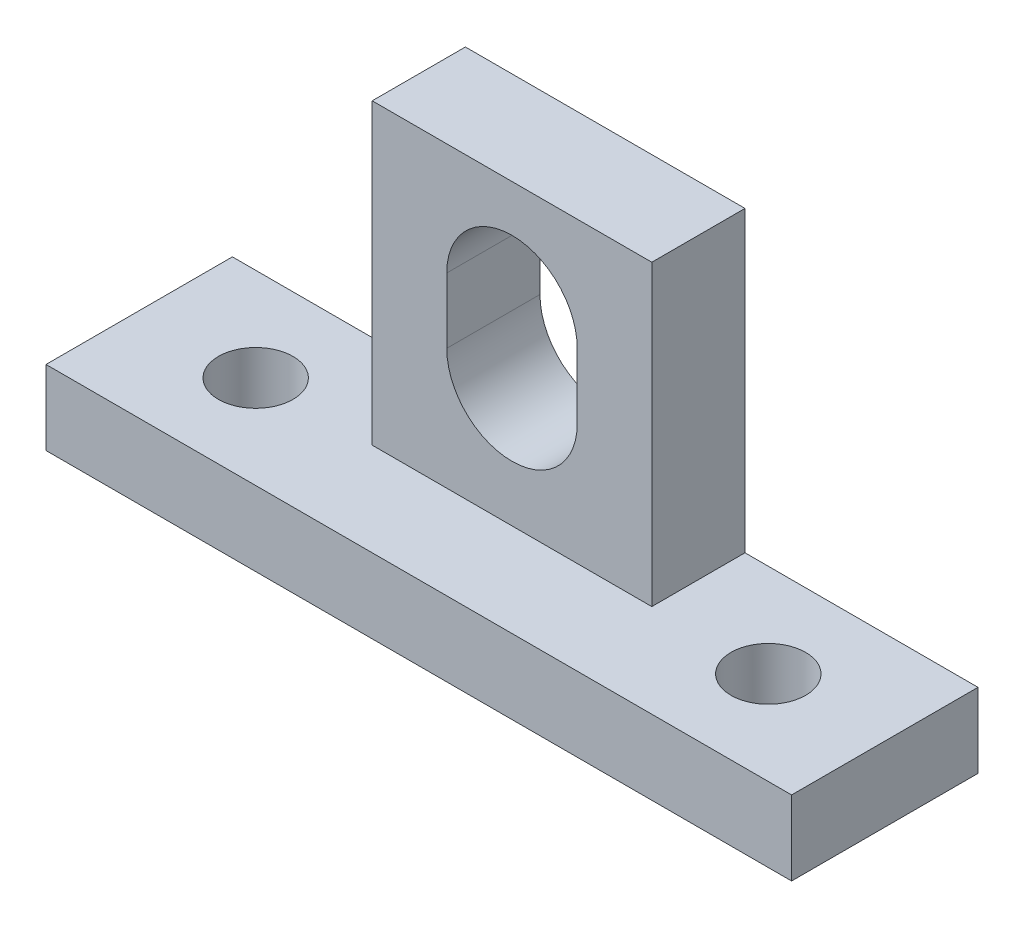
ISO-10303-21;
HEADER;
FILE_DESCRIPTION(('STEP AP214'),'2;1');
FILE_NAME('part.step','',(''),(''),'','','');
FILE_SCHEMA(('AUTOMOTIVE_DESIGN { 1 0 10303 214 1 1 1 1 }'));
ENDSEC;
DATA;
#1=APPLICATION_CONTEXT('core data for automotive mechanical design processes');
#2=APPLICATION_PROTOCOL_DEFINITION('international standard','automotive_design',2000,#1);
#3=PRODUCT_CONTEXT('',#1,'mechanical');
#4=PRODUCT('Part','Part','',(#3));
#5=PRODUCT_RELATED_PRODUCT_CATEGORY('part','',(#4));
#6=PRODUCT_DEFINITION_FORMATION('','',#4);
#7=PRODUCT_DEFINITION_CONTEXT('part definition',#1,'design');
#8=PRODUCT_DEFINITION('design','',#6,#7);
#9=PRODUCT_DEFINITION_SHAPE('','',#8);
#10=(LENGTH_UNIT() NAMED_UNIT(*) SI_UNIT(.MILLI.,.METRE.));
#11=(NAMED_UNIT(*) PLANE_ANGLE_UNIT() SI_UNIT($,.RADIAN.));
#12=(NAMED_UNIT(*) SI_UNIT($,.STERADIAN.) SOLID_ANGLE_UNIT());
#13=UNCERTAINTY_MEASURE_WITH_UNIT(LENGTH_MEASURE(1.E-05),#10,'distance_accuracy_value','');
#14=(GEOMETRIC_REPRESENTATION_CONTEXT(3) GLOBAL_UNCERTAINTY_ASSIGNED_CONTEXT((#13)) GLOBAL_UNIT_ASSIGNED_CONTEXT((#10,
#11,#12)) REPRESENTATION_CONTEXT('',''));
#15=CARTESIAN_POINT('',(0.,0.,0.));
#16=DIRECTION('',(0.,0.,1.));
#17=DIRECTION('',(1.,0.,0.));
#18=AXIS2_PLACEMENT_3D('',#15,#16,#17);
#19=CARTESIAN_POINT('',(0.,0.,10.));
#20=DIRECTION('',(0.,0.,1.));
#21=DIRECTION('',(1.,0.,0.));
#22=AXIS2_PLACEMENT_3D('',#19,#20,#21);
#23=PLANE('',#22);
#24=DIRECTION('',(-1.,0.,0.));
#25=VECTOR('',#24,1.);
#26=CARTESIAN_POINT('',(7.5,4.,10.));
#27=LINE('',#26,#25);
#28=CARTESIAN_POINT('',(20.,4.,10.));
#29=VERTEX_POINT('',#28);
#30=CARTESIAN_POINT('',(-20.,4.,10.));
#31=VERTEX_POINT('',#30);
#32=EDGE_CURVE('E191',#29,#31,#27,.T.);
#33=ORIENTED_EDGE('',*,*,#32,.T.);
#34=DIRECTION('',(0.,-1.,0.));
#35=VECTOR('',#34,1.);
#36=CARTESIAN_POINT('',(-20.,4.,10.));
#37=LINE('',#36,#35);
#38=CARTESIAN_POINT('',(-20.,0.,10.));
#39=VERTEX_POINT('',#38);
#40=EDGE_CURVE('E194',#31,#39,#37,.T.);
#41=ORIENTED_EDGE('',*,*,#40,.T.);
#42=DIRECTION('',(1.,0.,0.));
#43=VECTOR('',#42,1.);
#44=CARTESIAN_POINT('',(-20.,0.,10.));
#45=LINE('',#44,#43);
#46=CARTESIAN_POINT('',(20.,0.,10.));
#47=VERTEX_POINT('',#46);
#48=EDGE_CURVE('E196',#39,#47,#45,.T.);
#49=ORIENTED_EDGE('',*,*,#48,.T.);
#50=DIRECTION('',(0.,1.,0.));
#51=VECTOR('',#50,1.);
#52=CARTESIAN_POINT('',(20.,4.,10.));
#53=LINE('',#52,#51);
#54=EDGE_CURVE('E188',#47,#29,#53,.T.);
#55=ORIENTED_EDGE('',*,*,#54,.T.);
#56=EDGE_LOOP('',(#33,#41,#49,#55));
#57=FACE_BOUND('',#56,.T.);
#58=ADVANCED_FACE('F33',(#57),#23,.T.);
#59=CARTESIAN_POINT('',(0.,0.,0.));
#60=DIRECTION('',(0.,0.,1.));
#61=DIRECTION('',(1.,0.,0.));
#62=AXIS2_PLACEMENT_3D('',#59,#60,#61);
#63=PLANE('',#62);
#64=DIRECTION('',(0.,1.,0.));
#65=VECTOR('',#64,1.);
#66=CARTESIAN_POINT('',(20.,4.,0.));
#67=LINE('',#66,#65);
#68=CARTESIAN_POINT('',(20.,0.,0.));
#69=VERTEX_POINT('',#68);
#70=CARTESIAN_POINT('',(20.,4.,0.));
#71=VERTEX_POINT('',#70);
#72=EDGE_CURVE('E187',#69,#71,#67,.T.);
#73=ORIENTED_EDGE('',*,*,#72,.F.);
#74=DIRECTION('',(1.,0.,0.));
#75=VECTOR('',#74,1.);
#76=CARTESIAN_POINT('',(-20.,0.,0.));
#77=LINE('',#76,#75);
#78=CARTESIAN_POINT('',(-20.,0.,0.));
#79=VERTEX_POINT('',#78);
#80=EDGE_CURVE('E192',#79,#69,#77,.T.);
#81=ORIENTED_EDGE('',*,*,#80,.F.);
#82=DIRECTION('',(0.,-1.,0.));
#83=VECTOR('',#82,1.);
#84=CARTESIAN_POINT('',(-20.,4.,0.));
#85=LINE('',#84,#83);
#86=CARTESIAN_POINT('',(-20.,4.,0.));
#87=VERTEX_POINT('',#86);
#88=EDGE_CURVE('E212',#87,#79,#85,.T.);
#89=ORIENTED_EDGE('',*,*,#88,.F.);
#90=DIRECTION('',(-1.,0.,0.));
#91=VECTOR('',#90,1.);
#92=CARTESIAN_POINT('',(-7.5,4.,0.));
#93=LINE('',#92,#91);
#94=CARTESIAN_POINT('',(-7.5,4.,0.));
#95=VERTEX_POINT('',#94);
#96=EDGE_CURVE('E210',#95,#87,#93,.T.);
#97=ORIENTED_EDGE('',*,*,#96,.F.);
#98=DIRECTION('',(0.,-1.,0.));
#99=VECTOR('',#98,1.);
#100=CARTESIAN_POINT('',(-7.5,20.,0.));
#101=LINE('',#100,#99);
#102=CARTESIAN_POINT('',(-7.5,20.,0.));
#103=VERTEX_POINT('',#102);
#104=EDGE_CURVE('E207',#103,#95,#101,.T.);
#105=ORIENTED_EDGE('',*,*,#104,.F.);
#106=DIRECTION('',(-1.,0.,0.));
#107=VECTOR('',#106,1.);
#108=CARTESIAN_POINT('',(-7.5,20.,0.));
#109=LINE('',#108,#107);
#110=CARTESIAN_POINT('',(7.5,20.,0.));
#111=VERTEX_POINT('',#110);
#112=EDGE_CURVE('E205',#111,#103,#109,.T.);
#113=ORIENTED_EDGE('',*,*,#112,.F.);
#114=DIRECTION('',(0.,1.,0.));
#115=VECTOR('',#114,1.);
#116=CARTESIAN_POINT('',(7.5,20.,0.));
#117=LINE('',#116,#115);
#118=CARTESIAN_POINT('',(7.5,4.,0.));
#119=VERTEX_POINT('',#118);
#120=EDGE_CURVE('E138',#119,#111,#117,.T.);
#121=ORIENTED_EDGE('',*,*,#120,.F.);
#122=DIRECTION('',(-1.,0.,0.));
#123=VECTOR('',#122,1.);
#124=CARTESIAN_POINT('',(7.5,4.,0.));
#125=LINE('',#124,#123);
#126=EDGE_CURVE('E201',#71,#119,#125,.T.);
#127=ORIENTED_EDGE('',*,*,#126,.F.);
#128=EDGE_LOOP('',(#73,#81,#89,#97,#105,#113,#121,#127));
#129=FACE_BOUND('',#128,.T.);
#130=CARTESIAN_POINT('',(0.,14.,0.));
#131=DIRECTION('',(0.,0.,1.));
#132=DIRECTION('',(1.,0.,0.));
#133=AXIS2_PLACEMENT_3D('',#130,#131,#132);
#134=CIRCLE('',#133,3.5);
#135=CARTESIAN_POINT('',(3.5,14.,0.));
#136=VERTEX_POINT('',#135);
#137=CARTESIAN_POINT('',(-3.5,14.,0.));
#138=VERTEX_POINT('',#137);
#139=EDGE_CURVE('E151',#136,#138,#134,.T.);
#140=ORIENTED_EDGE('',*,*,#139,.T.);
#141=DIRECTION('',(0.,-1.,0.));
#142=VECTOR('',#141,1.);
#143=CARTESIAN_POINT('',(-3.5,10.5,0.));
#144=LINE('',#143,#142);
#145=CARTESIAN_POINT('',(-3.5,10.5,0.));
#146=VERTEX_POINT('',#145);
#147=EDGE_CURVE('E170',#138,#146,#144,.T.);
#148=ORIENTED_EDGE('',*,*,#147,.T.);
#149=CARTESIAN_POINT('',(0.,10.5,0.));
#150=DIRECTION('',(0.,0.,1.));
#151=DIRECTION('',(1.,0.,0.));
#152=AXIS2_PLACEMENT_3D('',#149,#150,#151);
#153=CIRCLE('',#152,3.5);
#154=CARTESIAN_POINT('',(3.5,10.5,0.));
#155=VERTEX_POINT('',#154);
#156=EDGE_CURVE('E173',#146,#155,#153,.T.);
#157=ORIENTED_EDGE('',*,*,#156,.T.);
#158=DIRECTION('',(0.,1.,0.));
#159=VECTOR('',#158,1.);
#160=CARTESIAN_POINT('',(3.5,14.,0.));
#161=LINE('',#160,#159);
#162=EDGE_CURVE('E176',#155,#136,#161,.T.);
#163=ORIENTED_EDGE('',*,*,#162,.T.);
#164=EDGE_LOOP('',(#140,#148,#157,#163));
#165=FACE_BOUND('',#164,.T.);
#166=ADVANCED_FACE('F234',(#129,#165),#63,.F.);
#167=CARTESIAN_POINT('',(20.,4.,10.));
#168=DIRECTION('',(-1.,0.,0.));
#169=DIRECTION('',(0.,-1.,0.));
#170=AXIS2_PLACEMENT_3D('',#167,#168,#169);
#171=PLANE('',#170);
#172=ORIENTED_EDGE('',*,*,#72,.T.);
#173=DIRECTION('',(0.,0.,-1.));
#174=VECTOR('',#173,1.);
#175=CARTESIAN_POINT('',(20.,4.,10.));
#176=LINE('',#175,#174);
#177=EDGE_CURVE('E41',#29,#71,#176,.T.);
#178=ORIENTED_EDGE('',*,*,#177,.F.);
#179=ORIENTED_EDGE('',*,*,#54,.F.);
#180=DIRECTION('',(0.,0.,-1.));
#181=VECTOR('',#180,1.);
#182=CARTESIAN_POINT('',(20.,0.,10.));
#183=LINE('',#182,#181);
#184=EDGE_CURVE('E198',#47,#69,#183,.T.);
#185=ORIENTED_EDGE('',*,*,#184,.T.);
#186=EDGE_LOOP('',(#172,#178,#179,#185));
#187=FACE_BOUND('',#186,.T.);
#188=ADVANCED_FACE('F35',(#187),#171,.F.);
#189=CARTESIAN_POINT('',(7.5,20.,10.));
#190=DIRECTION('',(-1.,0.,0.));
#191=DIRECTION('',(0.,-1.,0.));
#192=AXIS2_PLACEMENT_3D('',#189,#190,#191);
#193=PLANE('',#192);
#194=DIRECTION('',(0.,0.,-1.));
#195=VECTOR('',#194,1.);
#196=CARTESIAN_POINT('',(7.5,20.,10.));
#197=LINE('',#196,#195);
#198=CARTESIAN_POINT('',(7.5,20.,5.));
#199=VERTEX_POINT('',#198);
#200=EDGE_CURVE('E132',#199,#111,#197,.T.);
#201=ORIENTED_EDGE('',*,*,#200,.F.);
#202=DIRECTION('',(0.,-1.,0.));
#203=VECTOR('',#202,1.);
#204=CARTESIAN_POINT('',(7.5,20.,5.));
#205=LINE('',#204,#203);
#206=CARTESIAN_POINT('',(7.5,4.,5.));
#207=VERTEX_POINT('',#206);
#208=EDGE_CURVE('E119',#199,#207,#205,.T.);
#209=ORIENTED_EDGE('',*,*,#208,.T.);
#210=DIRECTION('',(0.,0.,-1.));
#211=VECTOR('',#210,1.);
#212=CARTESIAN_POINT('',(7.5,4.,10.));
#213=LINE('',#212,#211);
#214=EDGE_CURVE('E140',#207,#119,#213,.T.);
#215=ORIENTED_EDGE('',*,*,#214,.T.);
#216=ORIENTED_EDGE('',*,*,#120,.T.);
#217=EDGE_LOOP('',(#201,#209,#215,#216));
#218=FACE_BOUND('',#217,.T.);
#219=ADVANCED_FACE('F136',(#218),#193,.F.);
#220=CARTESIAN_POINT('',(-7.5,20.,10.));
#221=DIRECTION('',(0.,-1.,0.));
#222=DIRECTION('',(1.,0.,0.));
#223=AXIS2_PLACEMENT_3D('',#220,#221,#222);
#224=PLANE('',#223);
#225=DIRECTION('',(0.,0.,-1.));
#226=VECTOR('',#225,1.);
#227=CARTESIAN_POINT('',(-7.5,20.,10.));
#228=LINE('',#227,#226);
#229=CARTESIAN_POINT('',(-7.5,20.,5.));
#230=VERTEX_POINT('',#229);
#231=EDGE_CURVE('E134',#230,#103,#228,.T.);
#232=ORIENTED_EDGE('',*,*,#231,.F.);
#233=DIRECTION('',(-1.,0.,0.));
#234=VECTOR('',#233,1.);
#235=CARTESIAN_POINT('',(7.5,20.,5.));
#236=LINE('',#235,#234);
#237=EDGE_CURVE('E122',#199,#230,#236,.T.);
#238=ORIENTED_EDGE('',*,*,#237,.F.);
#239=ORIENTED_EDGE('',*,*,#200,.T.);
#240=ORIENTED_EDGE('',*,*,#112,.T.);
#241=EDGE_LOOP('',(#232,#238,#239,#240));
#242=FACE_BOUND('',#241,.T.);
#243=ADVANCED_FACE('F130',(#242),#224,.F.);
#244=CARTESIAN_POINT('',(-7.5,20.,10.));
#245=DIRECTION('',(1.,0.,0.));
#246=DIRECTION('',(0.,1.,0.));
#247=AXIS2_PLACEMENT_3D('',#244,#245,#246);
#248=PLANE('',#247);
#249=DIRECTION('',(0.,0.,-1.));
#250=VECTOR('',#249,1.);
#251=CARTESIAN_POINT('',(-7.5,4.,10.));
#252=LINE('',#251,#250);
#253=CARTESIAN_POINT('',(-7.5,4.,5.));
#254=VERTEX_POINT('',#253);
#255=EDGE_CURVE('E143',#254,#95,#252,.T.);
#256=ORIENTED_EDGE('',*,*,#255,.F.);
#257=DIRECTION('',(0.,-1.,0.));
#258=VECTOR('',#257,1.);
#259=CARTESIAN_POINT('',(-7.5,20.,5.));
#260=LINE('',#259,#258);
#261=EDGE_CURVE('E48',#230,#254,#260,.T.);
#262=ORIENTED_EDGE('',*,*,#261,.F.);
#263=ORIENTED_EDGE('',*,*,#231,.T.);
#264=ORIENTED_EDGE('',*,*,#104,.T.);
#265=EDGE_LOOP('',(#256,#262,#263,#264));
#266=FACE_BOUND('',#265,.T.);
#267=ADVANCED_FACE('F230',(#266),#248,.F.);
#268=CARTESIAN_POINT('',(-7.5,4.,10.));
#269=DIRECTION('',(0.,-1.,0.));
#270=DIRECTION('',(1.,0.,0.));
#271=AXIS2_PLACEMENT_3D('',#268,#269,#270);
#272=PLANE('',#271);
#273=CARTESIAN_POINT('',(-13.75,4.,5.));
#274=DIRECTION('',(0.,1.,0.));
#275=DIRECTION('',(-1.,0.,0.));
#276=AXIS2_PLACEMENT_3D('',#273,#274,#275);
#277=CIRCLE('',#276,2.);
#278=CARTESIAN_POINT('',(-15.75,4.,5.));
#279=VERTEX_POINT('',#278);
#280=EDGE_CURVE('E152',#279,#279,#277,.T.);
#281=ORIENTED_EDGE('',*,*,#280,.F.);
#282=EDGE_LOOP('',(#281));
#283=FACE_BOUND('',#282,.T.);
#284=ORIENTED_EDGE('',*,*,#96,.T.);
#285=DIRECTION('',(0.,0.,-1.));
#286=VECTOR('',#285,1.);
#287=CARTESIAN_POINT('',(-20.,4.,10.));
#288=LINE('',#287,#286);
#289=EDGE_CURVE('E220',#31,#87,#288,.T.);
#290=ORIENTED_EDGE('',*,*,#289,.F.);
#291=ORIENTED_EDGE('',*,*,#32,.F.);
#292=ORIENTED_EDGE('',*,*,#177,.T.);
#293=ORIENTED_EDGE('',*,*,#126,.T.);
#294=ORIENTED_EDGE('',*,*,#214,.F.);
#295=DIRECTION('',(-1.,0.,0.));
#296=VECTOR('',#295,1.);
#297=CARTESIAN_POINT('',(7.5,4.,5.));
#298=LINE('',#297,#296);
#299=EDGE_CURVE('E123',#207,#254,#298,.T.);
#300=ORIENTED_EDGE('',*,*,#299,.T.);
#301=ORIENTED_EDGE('',*,*,#255,.T.);
#302=EDGE_LOOP('',(#284,#290,#291,#292,#293,#294,#300,#301));
#303=FACE_BOUND('',#302,.T.);
#304=CARTESIAN_POINT('',(13.75,4.,5.));
#305=DIRECTION('',(0.,1.,0.));
#306=DIRECTION('',(1.,0.,0.));
#307=AXIS2_PLACEMENT_3D('',#304,#305,#306);
#308=CIRCLE('',#307,2.);
#309=CARTESIAN_POINT('',(15.75,4.,5.));
#310=VERTEX_POINT('',#309);
#311=EDGE_CURVE('E155',#310,#310,#308,.T.);
#312=ORIENTED_EDGE('',*,*,#311,.F.);
#313=EDGE_LOOP('',(#312));
#314=FACE_BOUND('',#313,.T.);
#315=ADVANCED_FACE('F224',(#283,#303,#314),#272,.F.);
#316=CARTESIAN_POINT('',(-20.,4.,10.));
#317=DIRECTION('',(1.,0.,0.));
#318=DIRECTION('',(0.,1.,0.));
#319=AXIS2_PLACEMENT_3D('',#316,#317,#318);
#320=PLANE('',#319);
#321=ORIENTED_EDGE('',*,*,#88,.T.);
#322=DIRECTION('',(0.,0.,-1.));
#323=VECTOR('',#322,1.);
#324=CARTESIAN_POINT('',(-20.,0.,10.));
#325=LINE('',#324,#323);
#326=EDGE_CURVE('E217',#39,#79,#325,.T.);
#327=ORIENTED_EDGE('',*,*,#326,.F.);
#328=ORIENTED_EDGE('',*,*,#40,.F.);
#329=ORIENTED_EDGE('',*,*,#289,.T.);
#330=EDGE_LOOP('',(#321,#327,#328,#329));
#331=FACE_BOUND('',#330,.T.);
#332=ADVANCED_FACE('F239',(#331),#320,.F.);
#333=CARTESIAN_POINT('',(-20.,0.,10.));
#334=DIRECTION('',(0.,1.,0.));
#335=DIRECTION('',(-1.,0.,0.));
#336=AXIS2_PLACEMENT_3D('',#333,#334,#335);
#337=PLANE('',#336);
#338=CARTESIAN_POINT('',(13.75,0.,5.));
#339=DIRECTION('',(0.,1.,0.));
#340=DIRECTION('',(-1.,0.,0.));
#341=AXIS2_PLACEMENT_3D('',#338,#339,#340);
#342=CIRCLE('',#341,2.);
#343=CARTESIAN_POINT('',(11.75,0.,5.));
#344=VERTEX_POINT('',#343);
#345=EDGE_CURVE('E153',#344,#344,#342,.T.);
#346=ORIENTED_EDGE('',*,*,#345,.T.);
#347=EDGE_LOOP('',(#346));
#348=FACE_BOUND('',#347,.T.);
#349=CARTESIAN_POINT('',(-13.75,0.,5.));
#350=DIRECTION('',(0.,1.,0.));
#351=DIRECTION('',(-1.,0.,0.));
#352=AXIS2_PLACEMENT_3D('',#349,#350,#351);
#353=CIRCLE('',#352,2.);
#354=CARTESIAN_POINT('',(-15.75,0.,5.));
#355=VERTEX_POINT('',#354);
#356=EDGE_CURVE('E149',#355,#355,#353,.T.);
#357=ORIENTED_EDGE('',*,*,#356,.T.);
#358=EDGE_LOOP('',(#357));
#359=FACE_BOUND('',#358,.T.);
#360=ORIENTED_EDGE('',*,*,#80,.T.);
#361=ORIENTED_EDGE('',*,*,#184,.F.);
#362=ORIENTED_EDGE('',*,*,#48,.F.);
#363=ORIENTED_EDGE('',*,*,#326,.T.);
#364=EDGE_LOOP('',(#360,#361,#362,#363));
#365=FACE_BOUND('',#364,.T.);
#366=ADVANCED_FACE('F243',(#348,#359,#365),#337,.F.);
#367=CARTESIAN_POINT('',(0.,14.,10.));
#368=DIRECTION('',(0.,0.,-1.));
#369=DIRECTION('',(-1.,0.,0.));
#370=AXIS2_PLACEMENT_3D('',#367,#368,#369);
#371=CYLINDRICAL_SURFACE('',#370,3.5);
#372=CARTESIAN_POINT('',(0.,14.,5.));
#373=DIRECTION('',(0.,0.,-1.));
#374=DIRECTION('',(0.,1.,0.));
#375=AXIS2_PLACEMENT_3D('',#372,#373,#374);
#376=CIRCLE('',#375,3.5);
#377=CARTESIAN_POINT('',(-3.5,14.,5.));
#378=VERTEX_POINT('',#377);
#379=CARTESIAN_POINT('',(3.5,14.,5.));
#380=VERTEX_POINT('',#379);
#381=EDGE_CURVE('E55',#378,#380,#376,.T.);
#382=ORIENTED_EDGE('',*,*,#381,.F.);
#383=DIRECTION('',(0.,0.,-1.));
#384=VECTOR('',#383,1.);
#385=CARTESIAN_POINT('',(-3.5,14.,10.));
#386=LINE('',#385,#384);
#387=EDGE_CURVE('E185',#378,#138,#386,.T.);
#388=ORIENTED_EDGE('',*,*,#387,.T.);
#389=ORIENTED_EDGE('',*,*,#139,.F.);
#390=DIRECTION('',(0.,0.,-1.));
#391=VECTOR('',#390,1.);
#392=CARTESIAN_POINT('',(3.5,14.,10.));
#393=LINE('',#392,#391);
#394=EDGE_CURVE('E179',#380,#136,#393,.T.);
#395=ORIENTED_EDGE('',*,*,#394,.F.);
#396=EDGE_LOOP('',(#382,#388,#389,#395));
#397=FACE_BOUND('',#396,.T.);
#398=ADVANCED_FACE('F260',(#397),#371,.F.);
#399=CARTESIAN_POINT('',(-3.5,10.5,10.));
#400=DIRECTION('',(1.,0.,0.));
#401=DIRECTION('',(0.,0.,-1.));
#402=AXIS2_PLACEMENT_3D('',#399,#400,#401);
#403=PLANE('',#402);
#404=DIRECTION('',(0.,1.,0.));
#405=VECTOR('',#404,1.);
#406=CARTESIAN_POINT('',(-3.5,10.5,5.));
#407=LINE('',#406,#405);
#408=CARTESIAN_POINT('',(-3.5,10.5,5.));
#409=VERTEX_POINT('',#408);
#410=EDGE_CURVE('E164',#409,#378,#407,.T.);
#411=ORIENTED_EDGE('',*,*,#410,.F.);
#412=DIRECTION('',(0.,0.,-1.));
#413=VECTOR('',#412,1.);
#414=CARTESIAN_POINT('',(-3.5,10.5,10.));
#415=LINE('',#414,#413);
#416=EDGE_CURVE('E183',#409,#146,#415,.T.);
#417=ORIENTED_EDGE('',*,*,#416,.T.);
#418=ORIENTED_EDGE('',*,*,#147,.F.);
#419=ORIENTED_EDGE('',*,*,#387,.F.);
#420=EDGE_LOOP('',(#411,#417,#418,#419));
#421=FACE_BOUND('',#420,.T.);
#422=ADVANCED_FACE('F300',(#421),#403,.T.);
#423=CARTESIAN_POINT('',(0.,10.5,10.));
#424=DIRECTION('',(0.,0.,-1.));
#425=DIRECTION('',(-1.,0.,0.));
#426=AXIS2_PLACEMENT_3D('',#423,#424,#425);
#427=CYLINDRICAL_SURFACE('',#426,3.5);
#428=CARTESIAN_POINT('',(0.,10.5,5.));
#429=DIRECTION('',(0.,0.,-1.));
#430=DIRECTION('',(0.,1.,0.));
#431=AXIS2_PLACEMENT_3D('',#428,#429,#430);
#432=CIRCLE('',#431,3.5);
#433=CARTESIAN_POINT('',(3.5,10.5,5.));
#434=VERTEX_POINT('',#433);
#435=EDGE_CURVE('E407',#434,#409,#432,.T.);
#436=ORIENTED_EDGE('',*,*,#435,.F.);
#437=DIRECTION('',(0.,0.,-1.));
#438=VECTOR('',#437,1.);
#439=CARTESIAN_POINT('',(3.5,10.5,10.));
#440=LINE('',#439,#438);
#441=EDGE_CURVE('E181',#434,#155,#440,.T.);
#442=ORIENTED_EDGE('',*,*,#441,.T.);
#443=ORIENTED_EDGE('',*,*,#156,.F.);
#444=ORIENTED_EDGE('',*,*,#416,.F.);
#445=EDGE_LOOP('',(#436,#442,#443,#444));
#446=FACE_BOUND('',#445,.T.);
#447=ADVANCED_FACE('F307',(#446),#427,.F.);
#448=CARTESIAN_POINT('',(3.5,14.,10.));
#449=DIRECTION('',(-1.,0.,0.));
#450=DIRECTION('',(0.,-1.,0.));
#451=AXIS2_PLACEMENT_3D('',#448,#449,#450);
#452=PLANE('',#451);
#453=DIRECTION('',(0.,-1.,0.));
#454=VECTOR('',#453,1.);
#455=CARTESIAN_POINT('',(3.5,14.,5.));
#456=LINE('',#455,#454);
#457=EDGE_CURVE('E11',#380,#434,#456,.T.);
#458=ORIENTED_EDGE('',*,*,#457,.F.);
#459=ORIENTED_EDGE('',*,*,#394,.T.);
#460=ORIENTED_EDGE('',*,*,#162,.F.);
#461=ORIENTED_EDGE('',*,*,#441,.F.);
#462=EDGE_LOOP('',(#458,#459,#460,#461));
#463=FACE_BOUND('',#462,.T.);
#464=ADVANCED_FACE('F314',(#463),#452,.T.);
#465=CARTESIAN_POINT('',(-13.75,-11.,5.));
#466=DIRECTION('',(0.,1.,0.));
#467=DIRECTION('',(-1.,0.,0.));
#468=AXIS2_PLACEMENT_3D('',#465,#466,#467);
#469=CYLINDRICAL_SURFACE('',#468,2.);
#470=ORIENTED_EDGE('',*,*,#280,.T.);
#471=EDGE_LOOP('',(#470));
#472=FACE_BOUND('',#471,.T.);
#473=ORIENTED_EDGE('',*,*,#356,.F.);
#474=EDGE_LOOP('',(#473));
#475=FACE_BOUND('',#474,.T.);
#476=ADVANCED_FACE('F322',(#472,#475),#469,.F.);
#477=CARTESIAN_POINT('',(13.75,-11.,5.));
#478=DIRECTION('',(0.,1.,0.));
#479=DIRECTION('',(-1.,0.,0.));
#480=AXIS2_PLACEMENT_3D('',#477,#478,#479);
#481=CYLINDRICAL_SURFACE('',#480,2.);
#482=ORIENTED_EDGE('',*,*,#311,.T.);
#483=EDGE_LOOP('',(#482));
#484=FACE_BOUND('',#483,.T.);
#485=ORIENTED_EDGE('',*,*,#345,.F.);
#486=EDGE_LOOP('',(#485));
#487=FACE_BOUND('',#486,.T.);
#488=ADVANCED_FACE('F330',(#484,#487),#481,.F.);
#489=CARTESIAN_POINT('',(7.5,20.,5.));
#490=DIRECTION('',(0.,0.,-1.));
#491=DIRECTION('',(0.,1.,0.));
#492=AXIS2_PLACEMENT_3D('',#489,#490,#491);
#493=PLANE('',#492);
#494=ORIENTED_EDGE('',*,*,#381,.T.);
#495=ORIENTED_EDGE('',*,*,#457,.T.);
#496=ORIENTED_EDGE('',*,*,#435,.T.);
#497=ORIENTED_EDGE('',*,*,#410,.T.);
#498=EDGE_LOOP('',(#494,#495,#496,#497));
#499=FACE_BOUND('',#498,.T.);
#500=ORIENTED_EDGE('',*,*,#261,.T.);
#501=ORIENTED_EDGE('',*,*,#299,.F.);
#502=ORIENTED_EDGE('',*,*,#208,.F.);
#503=ORIENTED_EDGE('',*,*,#237,.T.);
#504=EDGE_LOOP('',(#500,#501,#502,#503));
#505=FACE_BOUND('',#504,.T.);
#506=ADVANCED_FACE('F121',(#499,#505),#493,.F.);
#507=CLOSED_SHELL('',(#58,#166,#188,#219,#243,#267,#315,#332,#366,#398,#422,#447,#464,#476,#488,#506));
#508=MANIFOLD_SOLID_BREP('B2',#507);
#509=ADVANCED_BREP_SHAPE_REPRESENTATION('',(#18,#508),#14);
#510=SHAPE_DEFINITION_REPRESENTATION(#9,#509);
ENDSEC;
END-ISO-10303-21;
